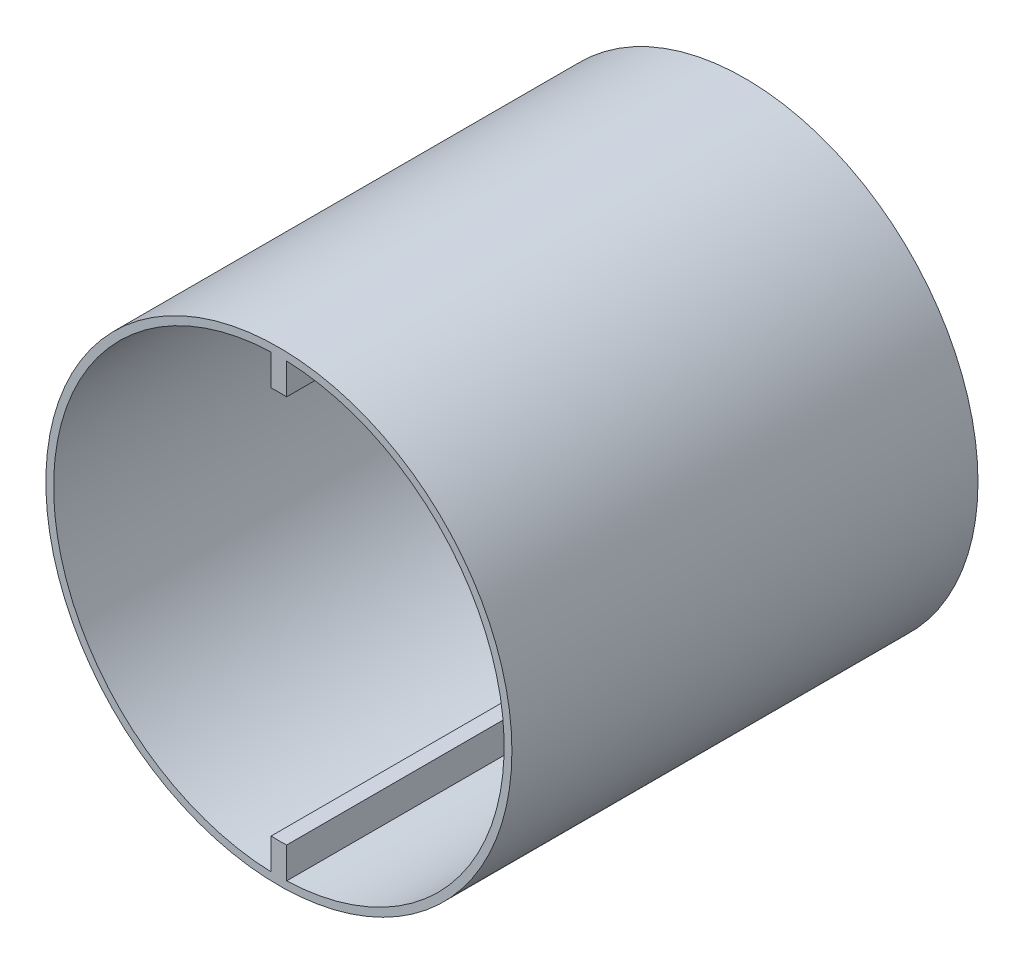
ISO-10303-21;
HEADER;
FILE_DESCRIPTION(('STEP AP214'),'2;1');
FILE_NAME('part.step','',(''),(''),'','','');
FILE_SCHEMA(('AUTOMOTIVE_DESIGN { 1 0 10303 214 1 1 1 1 }'));
ENDSEC;
DATA;
#1=APPLICATION_CONTEXT('core data for automotive mechanical design processes');
#2=APPLICATION_PROTOCOL_DEFINITION('international standard','automotive_design',2000,#1);
#3=PRODUCT_CONTEXT('',#1,'mechanical');
#4=PRODUCT('Part','Part','',(#3));
#5=PRODUCT_RELATED_PRODUCT_CATEGORY('part','',(#4));
#6=PRODUCT_DEFINITION_FORMATION('','',#4);
#7=PRODUCT_DEFINITION_CONTEXT('part definition',#1,'design');
#8=PRODUCT_DEFINITION('design','',#6,#7);
#9=PRODUCT_DEFINITION_SHAPE('','',#8);
#10=(LENGTH_UNIT() NAMED_UNIT(*) SI_UNIT(.MILLI.,.METRE.));
#11=(NAMED_UNIT(*) PLANE_ANGLE_UNIT() SI_UNIT($,.RADIAN.));
#12=(NAMED_UNIT(*) SI_UNIT($,.STERADIAN.) SOLID_ANGLE_UNIT());
#13=UNCERTAINTY_MEASURE_WITH_UNIT(LENGTH_MEASURE(1.E-05),#10,'distance_accuracy_value','');
#14=(GEOMETRIC_REPRESENTATION_CONTEXT(3) GLOBAL_UNCERTAINTY_ASSIGNED_CONTEXT((#13)) GLOBAL_UNIT_ASSIGNED_CONTEXT((#10,
#11,#12)) REPRESENTATION_CONTEXT('',''));
#15=CARTESIAN_POINT('',(0.,0.,0.));
#16=DIRECTION('',(0.,0.,1.));
#17=DIRECTION('',(1.,0.,0.));
#18=AXIS2_PLACEMENT_3D('',#15,#16,#17);
#19=CARTESIAN_POINT('',(0.,0.,33.));
#20=DIRECTION('',(0.,0.,1.));
#21=DIRECTION('',(1.,0.,0.));
#22=AXIS2_PLACEMENT_3D('',#19,#20,#21);
#23=PLANE('',#22);
#24=CARTESIAN_POINT('',(0.,0.,33.));
#25=DIRECTION('',(0.,0.,1.));
#26=DIRECTION('',(1.,0.,0.));
#27=AXIS2_PLACEMENT_3D('',#24,#25,#26);
#28=CIRCLE('',#27,2.225);
#29=CARTESIAN_POINT('',(2.225,0.,33.));
#30=VERTEX_POINT('',#29);
#31=EDGE_CURVE('E199',#30,#30,#28,.T.);
#32=ORIENTED_EDGE('',*,*,#31,.F.);
#33=EDGE_LOOP('',(#32));
#34=FACE_BOUND('',#33,.T.);
#35=CARTESIAN_POINT('',(0.,0.,33.));
#36=DIRECTION('',(0.,0.,1.));
#37=DIRECTION('',(1.,0.,0.));
#38=AXIS2_PLACEMENT_3D('',#35,#36,#37);
#39=CIRCLE('',#38,3.5);
#40=CARTESIAN_POINT('',(3.5,0.,33.));
#41=VERTEX_POINT('',#40);
#42=EDGE_CURVE('E47',#41,#41,#39,.T.);
#43=ORIENTED_EDGE('',*,*,#42,.T.);
#44=EDGE_LOOP('',(#43));
#45=FACE_BOUND('',#44,.T.);
#46=ADVANCED_FACE('F39',(#34,#45),#23,.T.);
#47=CARTESIAN_POINT('',(0.,0.,60.));
#48=DIRECTION('',(0.,0.,-1.));
#49=DIRECTION('',(-1.,0.,0.));
#50=AXIS2_PLACEMENT_3D('',#47,#48,#49);
#51=CYLINDRICAL_SURFACE('',#50,3.5);
#52=CARTESIAN_POINT('',(0.,0.,29.));
#53=DIRECTION('',(0.,0.,1.));
#54=DIRECTION('',(1.,0.,0.));
#55=AXIS2_PLACEMENT_3D('',#52,#53,#54);
#56=CIRCLE('',#55,3.5);
#57=CARTESIAN_POINT('',(1.,3.35410196624968,29.));
#58=VERTEX_POINT('',#57);
#59=CARTESIAN_POINT('',(-1.,3.35410196624968,29.));
#60=VERTEX_POINT('',#59);
#61=EDGE_CURVE('E129',#58,#60,#56,.T.);
#62=ORIENTED_EDGE('',*,*,#61,.T.);
#63=DIRECTION('',(0.,0.,-1.));
#64=VECTOR('',#63,1.);
#65=CARTESIAN_POINT('',(-1.,3.35410196624968,60.));
#66=LINE('',#65,#64);
#67=CARTESIAN_POINT('',(-1.,3.35410196624968,0.));
#68=VERTEX_POINT('',#67);
#69=EDGE_CURVE('E156',#60,#68,#66,.T.);
#70=ORIENTED_EDGE('',*,*,#69,.T.);
#71=CARTESIAN_POINT('',(0.,0.,0.));
#72=DIRECTION('',(0.,0.,1.));
#73=DIRECTION('',(1.,0.,0.));
#74=AXIS2_PLACEMENT_3D('',#71,#72,#73);
#75=CIRCLE('',#74,3.5);
#76=CARTESIAN_POINT('',(-1.,-3.35410196624968,0.));
#77=VERTEX_POINT('',#76);
#78=EDGE_CURVE('E242',#68,#77,#75,.T.);
#79=ORIENTED_EDGE('',*,*,#78,.T.);
#80=DIRECTION('',(0.,0.,-1.));
#81=VECTOR('',#80,1.);
#82=CARTESIAN_POINT('',(-1.,-3.35410196624968,60.));
#83=LINE('',#82,#81);
#84=CARTESIAN_POINT('',(-1.,-3.35410196624969,29.));
#85=VERTEX_POINT('',#84);
#86=EDGE_CURVE('E158',#85,#77,#83,.T.);
#87=ORIENTED_EDGE('',*,*,#86,.F.);
#88=CARTESIAN_POINT('',(1.,-3.35410196624968,29.));
#89=VERTEX_POINT('',#88);
#90=EDGE_CURVE('E140',#85,#89,#56,.T.);
#91=ORIENTED_EDGE('',*,*,#90,.T.);
#92=DIRECTION('',(0.,0.,-1.));
#93=VECTOR('',#92,1.);
#94=CARTESIAN_POINT('',(1.,-3.35410196624968,60.));
#95=LINE('',#94,#93);
#96=CARTESIAN_POINT('',(1.,-3.35410196624968,0.));
#97=VERTEX_POINT('',#96);
#98=EDGE_CURVE('E155',#89,#97,#95,.T.);
#99=ORIENTED_EDGE('',*,*,#98,.T.);
#100=CARTESIAN_POINT('',(0.,0.,0.));
#101=DIRECTION('',(0.,0.,1.));
#102=DIRECTION('',(1.,0.,0.));
#103=AXIS2_PLACEMENT_3D('',#100,#101,#102);
#104=CIRCLE('',#103,3.5);
#105=CARTESIAN_POINT('',(1.,3.35410196624968,0.));
#106=VERTEX_POINT('',#105);
#107=EDGE_CURVE('E153',#97,#106,#104,.T.);
#108=ORIENTED_EDGE('',*,*,#107,.T.);
#109=DIRECTION('',(0.,0.,-1.));
#110=VECTOR('',#109,1.);
#111=CARTESIAN_POINT('',(1.,3.35410196624968,60.));
#112=LINE('',#111,#110);
#113=EDGE_CURVE('E144',#58,#106,#112,.T.);
#114=ORIENTED_EDGE('',*,*,#113,.F.);
#115=EDGE_LOOP('',(#62,#70,#79,#87,#91,#99,#108,#114));
#116=FACE_BOUND('',#115,.T.);
#117=ORIENTED_EDGE('',*,*,#42,.F.);
#118=EDGE_LOOP('',(#117));
#119=FACE_BOUND('',#118,.T.);
#120=ADVANCED_FACE('F150',(#116,#119),#51,.T.);
#121=CARTESIAN_POINT('',(-1.,-3.35410196624968,60.));
#122=DIRECTION('',(1.,0.,0.));
#123=DIRECTION('',(0.,1.,0.));
#124=AXIS2_PLACEMENT_3D('',#121,#122,#123);
#125=PLANE('',#124);
#126=DIRECTION('',(0.,0.,1.));
#127=VECTOR('',#126,1.);
#128=CARTESIAN_POINT('',(-0.999999999999997,-24.9799919935936,33.));
#129=LINE('',#128,#127);
#130=CARTESIAN_POINT('',(-0.999999999999997,-24.9799919935936,60.));
#131=VERTEX_POINT('',#130);
#132=CARTESIAN_POINT('',(-0.999999999999997,-24.9799919935936,29.));
#133=VERTEX_POINT('',#132);
#134=EDGE_CURVE('E54',#131,#133,#129,.F.);
#135=ORIENTED_EDGE('',*,*,#134,.T.);
#136=DIRECTION('',(0.,-1.,0.));
#137=VECTOR('',#136,1.);
#138=CARTESIAN_POINT('',(-1.,-3.35410196624968,29.));
#139=LINE('',#138,#137);
#140=EDGE_CURVE('E196',#85,#133,#139,.T.);
#141=ORIENTED_EDGE('',*,*,#140,.F.);
#142=ORIENTED_EDGE('',*,*,#86,.T.);
#143=DIRECTION('',(0.,-1.,0.));
#144=VECTOR('',#143,1.);
#145=CARTESIAN_POINT('',(-1.,-3.35410196624968,0.));
#146=LINE('',#145,#144);
#147=CARTESIAN_POINT('',(-0.999999999999996,-28.9827534923789,0.));
#148=VERTEX_POINT('',#147);
#149=EDGE_CURVE('E253',#77,#148,#146,.T.);
#150=ORIENTED_EDGE('',*,*,#149,.T.);
#151=DIRECTION('',(0.,0.,1.));
#152=VECTOR('',#151,1.);
#153=CARTESIAN_POINT('',(-0.999999999999996,-28.9827534923789,0.));
#154=LINE('',#153,#152);
#155=CARTESIAN_POINT('',(-0.999999999999996,-28.9827534923789,60.));
#156=VERTEX_POINT('',#155);
#157=EDGE_CURVE('E239',#156,#148,#154,.F.);
#158=ORIENTED_EDGE('',*,*,#157,.F.);
#159=DIRECTION('',(0.,-1.,0.));
#160=VECTOR('',#159,1.);
#161=CARTESIAN_POINT('',(-1.,-3.35410196624968,60.));
#162=LINE('',#161,#160);
#163=EDGE_CURVE('E243',#131,#156,#162,.T.);
#164=ORIENTED_EDGE('',*,*,#163,.F.);
#165=EDGE_LOOP('',(#135,#141,#142,#150,#158,#164));
#166=FACE_BOUND('',#165,.T.);
#167=ADVANCED_FACE('F41',(#166),#125,.F.);
#168=CARTESIAN_POINT('',(1.,-15.0064685884307,60.));
#169=DIRECTION('',(-1.,0.,0.));
#170=DIRECTION('',(0.,0.,1.));
#171=AXIS2_PLACEMENT_3D('',#168,#169,#170);
#172=PLANE('',#171);
#173=DIRECTION('',(0.,1.,0.));
#174=VECTOR('',#173,1.);
#175=CARTESIAN_POINT('',(1.,-15.0064685884307,29.));
#176=LINE('',#175,#174);
#177=CARTESIAN_POINT('',(1.,-24.9799919935936,29.));
#178=VERTEX_POINT('',#177);
#179=EDGE_CURVE('E147',#178,#89,#176,.T.);
#180=ORIENTED_EDGE('',*,*,#179,.F.);
#181=DIRECTION('',(0.,0.,1.));
#182=VECTOR('',#181,1.);
#183=CARTESIAN_POINT('',(1.,-24.9799919935936,33.));
#184=LINE('',#183,#182);
#185=CARTESIAN_POINT('',(1.,-24.9799919935936,60.));
#186=VERTEX_POINT('',#185);
#187=EDGE_CURVE('E190',#178,#186,#184,.T.);
#188=ORIENTED_EDGE('',*,*,#187,.T.);
#189=DIRECTION('',(0.,1.,0.));
#190=VECTOR('',#189,1.);
#191=CARTESIAN_POINT('',(1.,-29.5,60.));
#192=LINE('',#191,#190);
#193=CARTESIAN_POINT('',(1.,-28.9827534923789,60.));
#194=VERTEX_POINT('',#193);
#195=EDGE_CURVE('E245',#194,#186,#192,.T.);
#196=ORIENTED_EDGE('',*,*,#195,.F.);
#197=DIRECTION('',(0.,0.,1.));
#198=VECTOR('',#197,1.);
#199=CARTESIAN_POINT('',(1.,-28.9827534923789,0.));
#200=LINE('',#199,#198);
#201=CARTESIAN_POINT('',(1.,-28.9827534923789,0.));
#202=VERTEX_POINT('',#201);
#203=EDGE_CURVE('E236',#202,#194,#200,.T.);
#204=ORIENTED_EDGE('',*,*,#203,.F.);
#205=DIRECTION('',(0.,1.,0.));
#206=VECTOR('',#205,1.);
#207=CARTESIAN_POINT('',(1.,-15.0064685884307,0.));
#208=LINE('',#207,#206);
#209=EDGE_CURVE('E255',#202,#97,#208,.T.);
#210=ORIENTED_EDGE('',*,*,#209,.T.);
#211=ORIENTED_EDGE('',*,*,#98,.F.);
#212=EDGE_LOOP('',(#180,#188,#196,#204,#210,#211));
#213=FACE_BOUND('',#212,.T.);
#214=ADVANCED_FACE('F175',(#213),#172,.F.);
#215=CARTESIAN_POINT('',(1.,3.35410196624968,60.));
#216=DIRECTION('',(-1.,0.,0.));
#217=DIRECTION('',(0.,-1.,0.));
#218=AXIS2_PLACEMENT_3D('',#215,#216,#217);
#219=PLANE('',#218);
#220=DIRECTION('',(0.,0.,1.));
#221=VECTOR('',#220,1.);
#222=CARTESIAN_POINT('',(1.,24.9799919935936,33.));
#223=LINE('',#222,#221);
#224=CARTESIAN_POINT('',(1.,24.9799919935936,60.));
#225=VERTEX_POINT('',#224);
#226=CARTESIAN_POINT('',(1.,24.9799919935936,29.));
#227=VERTEX_POINT('',#226);
#228=EDGE_CURVE('E146',#225,#227,#223,.F.);
#229=ORIENTED_EDGE('',*,*,#228,.T.);
#230=DIRECTION('',(0.,1.,0.));
#231=VECTOR('',#230,1.);
#232=CARTESIAN_POINT('',(1.,3.35410196624968,29.));
#233=LINE('',#232,#231);
#234=EDGE_CURVE('E133',#58,#227,#233,.T.);
#235=ORIENTED_EDGE('',*,*,#234,.F.);
#236=ORIENTED_EDGE('',*,*,#113,.T.);
#237=DIRECTION('',(0.,1.,0.));
#238=VECTOR('',#237,1.);
#239=CARTESIAN_POINT('',(1.,3.35410196624968,0.));
#240=LINE('',#239,#238);
#241=CARTESIAN_POINT('',(1.,28.9827534923789,0.));
#242=VERTEX_POINT('',#241);
#243=EDGE_CURVE('E258',#106,#242,#240,.T.);
#244=ORIENTED_EDGE('',*,*,#243,.T.);
#245=DIRECTION('',(0.,0.,1.));
#246=VECTOR('',#245,1.);
#247=CARTESIAN_POINT('',(1.,28.9827534923789,0.));
#248=LINE('',#247,#246);
#249=CARTESIAN_POINT('',(1.,28.9827534923789,60.));
#250=VERTEX_POINT('',#249);
#251=EDGE_CURVE('E233',#250,#242,#248,.F.);
#252=ORIENTED_EDGE('',*,*,#251,.F.);
#253=DIRECTION('',(0.,1.,0.));
#254=VECTOR('',#253,1.);
#255=CARTESIAN_POINT('',(1.,3.35410196624968,60.));
#256=LINE('',#255,#254);
#257=EDGE_CURVE('E62',#225,#250,#256,.T.);
#258=ORIENTED_EDGE('',*,*,#257,.F.);
#259=EDGE_LOOP('',(#229,#235,#236,#244,#252,#258));
#260=FACE_BOUND('',#259,.T.);
#261=ADVANCED_FACE('F143',(#260),#219,.F.);
#262=CARTESIAN_POINT('',(-1.,29.5,60.));
#263=DIRECTION('',(1.,0.,0.));
#264=DIRECTION('',(0.,1.,0.));
#265=AXIS2_PLACEMENT_3D('',#262,#263,#264);
#266=PLANE('',#265);
#267=DIRECTION('',(0.,-1.,0.));
#268=VECTOR('',#267,1.);
#269=CARTESIAN_POINT('',(-1.,29.5,29.));
#270=LINE('',#269,#268);
#271=CARTESIAN_POINT('',(-1.,24.9799919935936,29.));
#272=VERTEX_POINT('',#271);
#273=EDGE_CURVE('E11',#272,#60,#270,.T.);
#274=ORIENTED_EDGE('',*,*,#273,.F.);
#275=DIRECTION('',(0.,0.,1.));
#276=VECTOR('',#275,1.);
#277=CARTESIAN_POINT('',(-1.,24.9799919935936,33.));
#278=LINE('',#277,#276);
#279=CARTESIAN_POINT('',(-1.,24.9799919935936,60.));
#280=VERTEX_POINT('',#279);
#281=EDGE_CURVE('E210',#272,#280,#278,.T.);
#282=ORIENTED_EDGE('',*,*,#281,.T.);
#283=DIRECTION('',(0.,-1.,0.));
#284=VECTOR('',#283,1.);
#285=CARTESIAN_POINT('',(-1.,29.5,60.));
#286=LINE('',#285,#284);
#287=CARTESIAN_POINT('',(-1.,28.9827534923789,60.));
#288=VERTEX_POINT('',#287);
#289=EDGE_CURVE('E160',#288,#280,#286,.T.);
#290=ORIENTED_EDGE('',*,*,#289,.F.);
#291=DIRECTION('',(0.,0.,1.));
#292=VECTOR('',#291,1.);
#293=CARTESIAN_POINT('',(-1.,28.9827534923789,0.));
#294=LINE('',#293,#292);
#295=CARTESIAN_POINT('',(-1.,28.9827534923789,0.));
#296=VERTEX_POINT('',#295);
#297=EDGE_CURVE('E227',#296,#288,#294,.T.);
#298=ORIENTED_EDGE('',*,*,#297,.F.);
#299=DIRECTION('',(0.,-1.,0.));
#300=VECTOR('',#299,1.);
#301=CARTESIAN_POINT('',(-1.,29.5,0.));
#302=LINE('',#301,#300);
#303=EDGE_CURVE('E246',#296,#68,#302,.T.);
#304=ORIENTED_EDGE('',*,*,#303,.T.);
#305=ORIENTED_EDGE('',*,*,#69,.F.);
#306=EDGE_LOOP('',(#274,#282,#290,#298,#304,#305));
#307=FACE_BOUND('',#306,.T.);
#308=ADVANCED_FACE('F186',(#307),#266,.F.);
#309=CARTESIAN_POINT('',(0.,0.,60.));
#310=DIRECTION('',(0.,0.,1.));
#311=DIRECTION('',(1.,0.,0.));
#312=AXIS2_PLACEMENT_3D('',#309,#310,#311);
#313=PLANE('',#312);
#314=CARTESIAN_POINT('',(0.,0.,60.));
#315=DIRECTION('',(0.,0.,1.));
#316=DIRECTION('',(1.,0.,0.));
#317=AXIS2_PLACEMENT_3D('',#314,#315,#316);
#318=CIRCLE('',#317,25.);
#319=EDGE_CURVE('E206',#225,#280,#318,.T.);
#320=ORIENTED_EDGE('',*,*,#319,.F.);
#321=ORIENTED_EDGE('',*,*,#257,.T.);
#322=CARTESIAN_POINT('',(0.,0.,60.));
#323=DIRECTION('',(0.,0.,1.));
#324=DIRECTION('',(1.,0.,0.));
#325=AXIS2_PLACEMENT_3D('',#322,#323,#324);
#326=CIRCLE('',#325,29.);
#327=EDGE_CURVE('E216',#194,#250,#326,.T.);
#328=ORIENTED_EDGE('',*,*,#327,.F.);
#329=ORIENTED_EDGE('',*,*,#195,.T.);
#330=CARTESIAN_POINT('',(0.,0.,60.));
#331=DIRECTION('',(0.,0.,1.));
#332=DIRECTION('',(1.,0.,0.));
#333=AXIS2_PLACEMENT_3D('',#330,#331,#332);
#334=CIRCLE('',#333,25.);
#335=EDGE_CURVE('E165',#131,#186,#334,.T.);
#336=ORIENTED_EDGE('',*,*,#335,.F.);
#337=ORIENTED_EDGE('',*,*,#163,.T.);
#338=EDGE_CURVE('E221',#288,#156,#326,.T.);
#339=ORIENTED_EDGE('',*,*,#338,.F.);
#340=ORIENTED_EDGE('',*,*,#289,.T.);
#341=EDGE_LOOP('',(#320,#321,#328,#329,#336,#337,#339,#340));
#342=FACE_BOUND('',#341,.T.);
#343=CARTESIAN_POINT('',(0.,0.,60.));
#344=DIRECTION('',(0.,0.,1.));
#345=DIRECTION('',(1.,0.,0.));
#346=AXIS2_PLACEMENT_3D('',#343,#344,#345);
#347=CIRCLE('',#346,30.);
#348=CARTESIAN_POINT('',(30.,0.,60.));
#349=VERTEX_POINT('',#348);
#350=EDGE_CURVE('E228',#349,#349,#347,.T.);
#351=ORIENTED_EDGE('',*,*,#350,.T.);
#352=EDGE_LOOP('',(#351));
#353=FACE_BOUND('',#352,.T.);
#354=ADVANCED_FACE('F277',(#342,#353),#313,.T.);
#355=CARTESIAN_POINT('',(0.,0.,0.));
#356=DIRECTION('',(0.,0.,1.));
#357=DIRECTION('',(1.,0.,0.));
#358=AXIS2_PLACEMENT_3D('',#355,#356,#357);
#359=PLANE('',#358);
#360=ORIENTED_EDGE('',*,*,#209,.F.);
#361=CARTESIAN_POINT('',(0.,0.,0.));
#362=DIRECTION('',(0.,0.,1.));
#363=DIRECTION('',(1.,0.,0.));
#364=AXIS2_PLACEMENT_3D('',#361,#362,#363);
#365=CIRCLE('',#364,29.);
#366=EDGE_CURVE('E217',#202,#242,#365,.T.);
#367=ORIENTED_EDGE('',*,*,#366,.T.);
#368=ORIENTED_EDGE('',*,*,#243,.F.);
#369=ORIENTED_EDGE('',*,*,#107,.F.);
#370=EDGE_LOOP('',(#360,#367,#368,#369));
#371=FACE_BOUND('',#370,.T.);
#372=EDGE_CURVE('E220',#296,#148,#365,.T.);
#373=ORIENTED_EDGE('',*,*,#372,.T.);
#374=ORIENTED_EDGE('',*,*,#149,.F.);
#375=ORIENTED_EDGE('',*,*,#78,.F.);
#376=ORIENTED_EDGE('',*,*,#303,.F.);
#377=EDGE_LOOP('',(#373,#374,#375,#376));
#378=FACE_BOUND('',#377,.T.);
#379=CARTESIAN_POINT('',(0.,0.,0.));
#380=DIRECTION('',(0.,0.,1.));
#381=DIRECTION('',(1.,0.,0.));
#382=AXIS2_PLACEMENT_3D('',#379,#380,#381);
#383=CIRCLE('',#382,30.);
#384=CARTESIAN_POINT('',(30.,0.,0.));
#385=VERTEX_POINT('',#384);
#386=EDGE_CURVE('E224',#385,#385,#383,.T.);
#387=ORIENTED_EDGE('',*,*,#386,.F.);
#388=EDGE_LOOP('',(#387));
#389=FACE_BOUND('',#388,.T.);
#390=ADVANCED_FACE('F267',(#371,#378,#389),#359,.F.);
#391=CARTESIAN_POINT('',(0.,0.,0.));
#392=DIRECTION('',(0.,0.,1.));
#393=DIRECTION('',(1.,0.,0.));
#394=AXIS2_PLACEMENT_3D('',#391,#392,#393);
#395=CYLINDRICAL_SURFACE('',#394,29.);
#396=ORIENTED_EDGE('',*,*,#338,.T.);
#397=ORIENTED_EDGE('',*,*,#157,.T.);
#398=ORIENTED_EDGE('',*,*,#372,.F.);
#399=ORIENTED_EDGE('',*,*,#297,.T.);
#400=EDGE_LOOP('',(#396,#397,#398,#399));
#401=FACE_BOUND('',#400,.T.);
#402=ADVANCED_FACE('F281',(#401),#395,.F.);
#403=ORIENTED_EDGE('',*,*,#366,.F.);
#404=ORIENTED_EDGE('',*,*,#203,.T.);
#405=ORIENTED_EDGE('',*,*,#327,.T.);
#406=ORIENTED_EDGE('',*,*,#251,.T.);
#407=EDGE_LOOP('',(#403,#404,#405,#406));
#408=FACE_BOUND('',#407,.T.);
#409=ADVANCED_FACE('F283',(#408),#395,.F.);
#410=CARTESIAN_POINT('',(0.,0.,0.));
#411=DIRECTION('',(0.,0.,1.));
#412=DIRECTION('',(1.,0.,0.));
#413=AXIS2_PLACEMENT_3D('',#410,#411,#412);
#414=CYLINDRICAL_SURFACE('',#413,30.);
#415=ORIENTED_EDGE('',*,*,#386,.T.);
#416=EDGE_LOOP('',(#415));
#417=FACE_BOUND('',#416,.T.);
#418=ORIENTED_EDGE('',*,*,#350,.F.);
#419=EDGE_LOOP('',(#418));
#420=FACE_BOUND('',#419,.T.);
#421=ADVANCED_FACE('F289',(#417,#420),#414,.T.);
#422=CARTESIAN_POINT('',(0.,0.,33.));
#423=DIRECTION('',(0.,0.,1.));
#424=DIRECTION('',(1.,0.,0.));
#425=AXIS2_PLACEMENT_3D('',#422,#423,#424);
#426=CYLINDRICAL_SURFACE('',#425,25.);
#427=ORIENTED_EDGE('',*,*,#335,.T.);
#428=ORIENTED_EDGE('',*,*,#187,.F.);
#429=CARTESIAN_POINT('',(0.,0.,29.));
#430=DIRECTION('',(0.,0.,1.));
#431=DIRECTION('',(1.,0.,0.));
#432=AXIS2_PLACEMENT_3D('',#429,#430,#431);
#433=CIRCLE('',#432,25.);
#434=EDGE_CURVE('E139',#133,#178,#433,.T.);
#435=ORIENTED_EDGE('',*,*,#434,.F.);
#436=ORIENTED_EDGE('',*,*,#134,.F.);
#437=EDGE_LOOP('',(#427,#428,#435,#436));
#438=FACE_BOUND('',#437,.T.);
#439=ADVANCED_FACE('F274',(#438),#426,.F.);
#440=ORIENTED_EDGE('',*,*,#319,.T.);
#441=ORIENTED_EDGE('',*,*,#281,.F.);
#442=EDGE_CURVE('E148',#227,#272,#433,.T.);
#443=ORIENTED_EDGE('',*,*,#442,.F.);
#444=ORIENTED_EDGE('',*,*,#228,.F.);
#445=EDGE_LOOP('',(#440,#441,#443,#444));
#446=FACE_BOUND('',#445,.T.);
#447=ADVANCED_FACE('F339',(#446),#426,.F.);
#448=CARTESIAN_POINT('',(0.,0.,31.));
#449=DIRECTION('',(0.,0.,1.));
#450=DIRECTION('',(1.,0.,0.));
#451=AXIS2_PLACEMENT_3D('',#448,#449,#450);
#452=CYLINDRICAL_SURFACE('',#451,2.225);
#453=CARTESIAN_POINT('',(0.,0.,31.));
#454=DIRECTION('',(0.,0.,1.));
#455=DIRECTION('',(1.,0.,0.));
#456=AXIS2_PLACEMENT_3D('',#453,#454,#455);
#457=CIRCLE('',#456,2.225);
#458=CARTESIAN_POINT('',(2.225,0.,31.));
#459=VERTEX_POINT('',#458);
#460=EDGE_CURVE('E203',#459,#459,#457,.T.);
#461=ORIENTED_EDGE('',*,*,#460,.F.);
#462=EDGE_LOOP('',(#461));
#463=FACE_BOUND('',#462,.T.);
#464=ORIENTED_EDGE('',*,*,#31,.T.);
#465=EDGE_LOOP('',(#464));
#466=FACE_BOUND('',#465,.T.);
#467=ADVANCED_FACE('F345',(#463,#466),#452,.F.);
#468=CARTESIAN_POINT('',(0.,0.,31.));
#469=DIRECTION('',(0.,0.,1.));
#470=DIRECTION('',(1.,0.,0.));
#471=AXIS2_PLACEMENT_3D('',#468,#469,#470);
#472=PLANE('',#471);
#473=ORIENTED_EDGE('',*,*,#460,.T.);
#474=EDGE_LOOP('',(#473));
#475=FACE_BOUND('',#474,.T.);
#476=ADVANCED_FACE('F351',(#475),#472,.T.);
#477=CARTESIAN_POINT('',(0.,0.,29.));
#478=DIRECTION('',(0.,0.,1.));
#479=DIRECTION('',(1.,0.,0.));
#480=AXIS2_PLACEMENT_3D('',#477,#478,#479);
#481=PLANE('',#480);
#482=ORIENTED_EDGE('',*,*,#140,.T.);
#483=ORIENTED_EDGE('',*,*,#434,.T.);
#484=ORIENTED_EDGE('',*,*,#179,.T.);
#485=ORIENTED_EDGE('',*,*,#90,.F.);
#486=EDGE_LOOP('',(#482,#483,#484,#485));
#487=FACE_BOUND('',#486,.T.);
#488=ADVANCED_FACE('F273',(#487),#481,.T.);
#489=ORIENTED_EDGE('',*,*,#234,.T.);
#490=ORIENTED_EDGE('',*,*,#442,.T.);
#491=ORIENTED_EDGE('',*,*,#273,.T.);
#492=ORIENTED_EDGE('',*,*,#61,.F.);
#493=EDGE_LOOP('',(#489,#490,#491,#492));
#494=FACE_BOUND('',#493,.T.);
#495=ADVANCED_FACE('F131',(#494),#481,.T.);
#496=CLOSED_SHELL('',(#46,#120,#167,#214,#261,#308,#354,#390,#402,#409,#421,#439,#447,#467,#476,
#488,#495));
#497=MANIFOLD_SOLID_BREP('B2',#496);
#498=ADVANCED_BREP_SHAPE_REPRESENTATION('',(#18,#497),#14);
#499=SHAPE_DEFINITION_REPRESENTATION(#9,#498);
ENDSEC;
END-ISO-10303-21;
